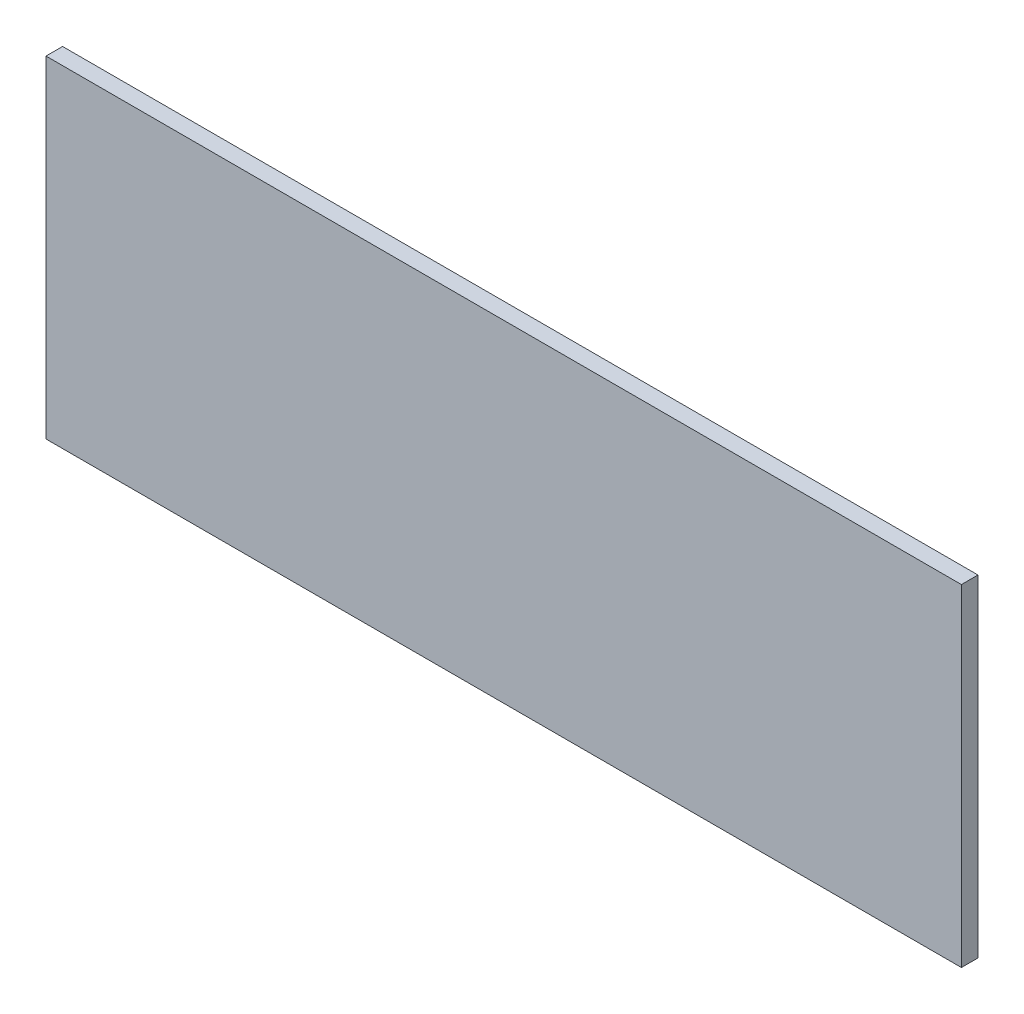
ISO-10303-21;
HEADER;
FILE_DESCRIPTION(('STEP AP214'),'2;1');
FILE_NAME('part.step','',(''),(''),'','','');
FILE_SCHEMA(('AUTOMOTIVE_DESIGN { 1 0 10303 214 1 1 1 1 }'));
ENDSEC;
DATA;
#1=APPLICATION_CONTEXT('core data for automotive mechanical design processes');
#2=APPLICATION_PROTOCOL_DEFINITION('international standard','automotive_design',2000,#1);
#3=PRODUCT_CONTEXT('',#1,'mechanical');
#4=PRODUCT('Part','Part','',(#3));
#5=PRODUCT_RELATED_PRODUCT_CATEGORY('part','',(#4));
#6=PRODUCT_DEFINITION_FORMATION('','',#4);
#7=PRODUCT_DEFINITION_CONTEXT('part definition',#1,'design');
#8=PRODUCT_DEFINITION('design','',#6,#7);
#9=PRODUCT_DEFINITION_SHAPE('','',#8);
#10=(LENGTH_UNIT() NAMED_UNIT(*) SI_UNIT(.MILLI.,.METRE.));
#11=(NAMED_UNIT(*) PLANE_ANGLE_UNIT() SI_UNIT($,.RADIAN.));
#12=(NAMED_UNIT(*) SI_UNIT($,.STERADIAN.) SOLID_ANGLE_UNIT());
#13=UNCERTAINTY_MEASURE_WITH_UNIT(LENGTH_MEASURE(1.E-05),#10,'distance_accuracy_value','');
#14=(GEOMETRIC_REPRESENTATION_CONTEXT(3) GLOBAL_UNCERTAINTY_ASSIGNED_CONTEXT((#13)) GLOBAL_UNIT_ASSIGNED_CONTEXT((#10,
#11,#12)) REPRESENTATION_CONTEXT('',''));
#15=CARTESIAN_POINT('',(0.,0.,0.));
#16=DIRECTION('',(0.,0.,1.));
#17=DIRECTION('',(1.,0.,0.));
#18=AXIS2_PLACEMENT_3D('',#15,#16,#17);
#19=CARTESIAN_POINT('',(345.,125.,12.5));
#20=DIRECTION('',(-1.,0.,0.));
#21=DIRECTION('',(0.,-1.,0.));
#22=AXIS2_PLACEMENT_3D('',#19,#20,#21);
#23=PLANE('',#22);
#24=DIRECTION('',(0.,1.,0.));
#25=VECTOR('',#24,1.);
#26=CARTESIAN_POINT('',(345.,125.,0.));
#27=LINE('',#26,#25);
#28=CARTESIAN_POINT('',(345.,-125.,0.));
#29=VERTEX_POINT('',#28);
#30=CARTESIAN_POINT('',(345.,125.,0.));
#31=VERTEX_POINT('',#30);
#32=EDGE_CURVE('E97',#29,#31,#27,.T.);
#33=ORIENTED_EDGE('',*,*,#32,.T.);
#34=DIRECTION('',(0.,0.,-1.));
#35=VECTOR('',#34,1.);
#36=CARTESIAN_POINT('',(345.,125.,12.5));
#37=LINE('',#36,#35);
#38=CARTESIAN_POINT('',(345.,125.,12.5));
#39=VERTEX_POINT('',#38);
#40=EDGE_CURVE('E11',#39,#31,#37,.T.);
#41=ORIENTED_EDGE('',*,*,#40,.F.);
#42=DIRECTION('',(0.,1.,0.));
#43=VECTOR('',#42,1.);
#44=CARTESIAN_POINT('',(345.,125.,12.5));
#45=LINE('',#44,#43);
#46=CARTESIAN_POINT('',(345.,-125.,12.5));
#47=VERTEX_POINT('',#46);
#48=EDGE_CURVE('E85',#47,#39,#45,.T.);
#49=ORIENTED_EDGE('',*,*,#48,.F.);
#50=DIRECTION('',(0.,0.,-1.));
#51=VECTOR('',#50,1.);
#52=CARTESIAN_POINT('',(345.,-125.,12.5));
#53=LINE('',#52,#51);
#54=EDGE_CURVE('E93',#47,#29,#53,.T.);
#55=ORIENTED_EDGE('',*,*,#54,.T.);
#56=EDGE_LOOP('',(#33,#41,#49,#55));
#57=FACE_BOUND('',#56,.T.);
#58=ADVANCED_FACE('F34',(#57),#23,.F.);
#59=CARTESIAN_POINT('',(-345.,125.,12.5));
#60=DIRECTION('',(0.,-1.,0.));
#61=DIRECTION('',(0.,0.,-1.));
#62=AXIS2_PLACEMENT_3D('',#59,#60,#61);
#63=PLANE('',#62);
#64=DIRECTION('',(-1.,0.,0.));
#65=VECTOR('',#64,1.);
#66=CARTESIAN_POINT('',(-345.,125.,0.));
#67=LINE('',#66,#65);
#68=CARTESIAN_POINT('',(-345.,125.,0.));
#69=VERTEX_POINT('',#68);
#70=EDGE_CURVE('E89',#31,#69,#67,.T.);
#71=ORIENTED_EDGE('',*,*,#70,.T.);
#72=DIRECTION('',(0.,0.,-1.));
#73=VECTOR('',#72,1.);
#74=CARTESIAN_POINT('',(-345.,125.,12.5));
#75=LINE('',#74,#73);
#76=CARTESIAN_POINT('',(-345.,125.,12.5));
#77=VERTEX_POINT('',#76);
#78=EDGE_CURVE('E42',#77,#69,#75,.T.);
#79=ORIENTED_EDGE('',*,*,#78,.F.);
#80=DIRECTION('',(-1.,0.,0.));
#81=VECTOR('',#80,1.);
#82=CARTESIAN_POINT('',(-345.,125.,12.5));
#83=LINE('',#82,#81);
#84=EDGE_CURVE('E80',#39,#77,#83,.T.);
#85=ORIENTED_EDGE('',*,*,#84,.F.);
#86=ORIENTED_EDGE('',*,*,#40,.T.);
#87=EDGE_LOOP('',(#71,#79,#85,#86));
#88=FACE_BOUND('',#87,.T.);
#89=ADVANCED_FACE('F88',(#88),#63,.F.);
#90=CARTESIAN_POINT('',(-345.,125.,12.5));
#91=DIRECTION('',(1.,0.,0.));
#92=DIRECTION('',(0.,1.,0.));
#93=AXIS2_PLACEMENT_3D('',#90,#91,#92);
#94=PLANE('',#93);
#95=DIRECTION('',(0.,-1.,0.));
#96=VECTOR('',#95,1.);
#97=CARTESIAN_POINT('',(-345.,125.,0.));
#98=LINE('',#97,#96);
#99=CARTESIAN_POINT('',(-345.,-125.,0.));
#100=VERTEX_POINT('',#99);
#101=EDGE_CURVE('E67',#69,#100,#98,.T.);
#102=ORIENTED_EDGE('',*,*,#101,.T.);
#103=DIRECTION('',(0.,0.,-1.));
#104=VECTOR('',#103,1.);
#105=CARTESIAN_POINT('',(-345.,-125.,12.5));
#106=LINE('',#105,#104);
#107=CARTESIAN_POINT('',(-345.,-125.,12.5));
#108=VERTEX_POINT('',#107);
#109=EDGE_CURVE('E90',#108,#100,#106,.T.);
#110=ORIENTED_EDGE('',*,*,#109,.F.);
#111=DIRECTION('',(0.,-1.,0.));
#112=VECTOR('',#111,1.);
#113=CARTESIAN_POINT('',(-345.,125.,12.5));
#114=LINE('',#113,#112);
#115=EDGE_CURVE('E83',#77,#108,#114,.T.);
#116=ORIENTED_EDGE('',*,*,#115,.F.);
#117=ORIENTED_EDGE('',*,*,#78,.T.);
#118=EDGE_LOOP('',(#102,#110,#116,#117));
#119=FACE_BOUND('',#118,.T.);
#120=ADVANCED_FACE('F91',(#119),#94,.F.);
#121=CARTESIAN_POINT('',(-345.,-125.,12.5));
#122=DIRECTION('',(0.,1.,0.));
#123=DIRECTION('',(-1.,0.,0.));
#124=AXIS2_PLACEMENT_3D('',#121,#122,#123);
#125=PLANE('',#124);
#126=DIRECTION('',(1.,0.,0.));
#127=VECTOR('',#126,1.);
#128=CARTESIAN_POINT('',(-345.,-125.,0.));
#129=LINE('',#128,#127);
#130=EDGE_CURVE('E73',#100,#29,#129,.T.);
#131=ORIENTED_EDGE('',*,*,#130,.T.);
#132=ORIENTED_EDGE('',*,*,#54,.F.);
#133=DIRECTION('',(1.,0.,0.));
#134=VECTOR('',#133,1.);
#135=CARTESIAN_POINT('',(-345.,-125.,12.5));
#136=LINE('',#135,#134);
#137=EDGE_CURVE('E50',#108,#47,#136,.T.);
#138=ORIENTED_EDGE('',*,*,#137,.F.);
#139=ORIENTED_EDGE('',*,*,#109,.T.);
#140=EDGE_LOOP('',(#131,#132,#138,#139));
#141=FACE_BOUND('',#140,.T.);
#142=ADVANCED_FACE('F104',(#141),#125,.F.);
#143=CARTESIAN_POINT('',(0.,0.,12.5));
#144=DIRECTION('',(0.,0.,1.));
#145=DIRECTION('',(1.,0.,0.));
#146=AXIS2_PLACEMENT_3D('',#143,#144,#145);
#147=PLANE('',#146);
#148=ORIENTED_EDGE('',*,*,#48,.T.);
#149=ORIENTED_EDGE('',*,*,#84,.T.);
#150=ORIENTED_EDGE('',*,*,#115,.T.);
#151=ORIENTED_EDGE('',*,*,#137,.T.);
#152=EDGE_LOOP('',(#148,#149,#150,#151));
#153=FACE_BOUND('',#152,.T.);
#154=ADVANCED_FACE('F81',(#153),#147,.T.);
#155=CARTESIAN_POINT('',(0.,0.,0.));
#156=DIRECTION('',(0.,0.,1.));
#157=DIRECTION('',(1.,0.,0.));
#158=AXIS2_PLACEMENT_3D('',#155,#156,#157);
#159=PLANE('',#158);
#160=ORIENTED_EDGE('',*,*,#32,.F.);
#161=ORIENTED_EDGE('',*,*,#130,.F.);
#162=ORIENTED_EDGE('',*,*,#101,.F.);
#163=ORIENTED_EDGE('',*,*,#70,.F.);
#164=EDGE_LOOP('',(#160,#161,#162,#163));
#165=FACE_BOUND('',#164,.T.);
#166=ADVANCED_FACE('F107',(#165),#159,.F.);
#167=CLOSED_SHELL('',(#58,#89,#120,#142,#154,#166));
#168=MANIFOLD_SOLID_BREP('B2',#167);
#169=ADVANCED_BREP_SHAPE_REPRESENTATION('',(#18,#168),#14);
#170=SHAPE_DEFINITION_REPRESENTATION(#9,#169);
ENDSEC;
END-ISO-10303-21;
